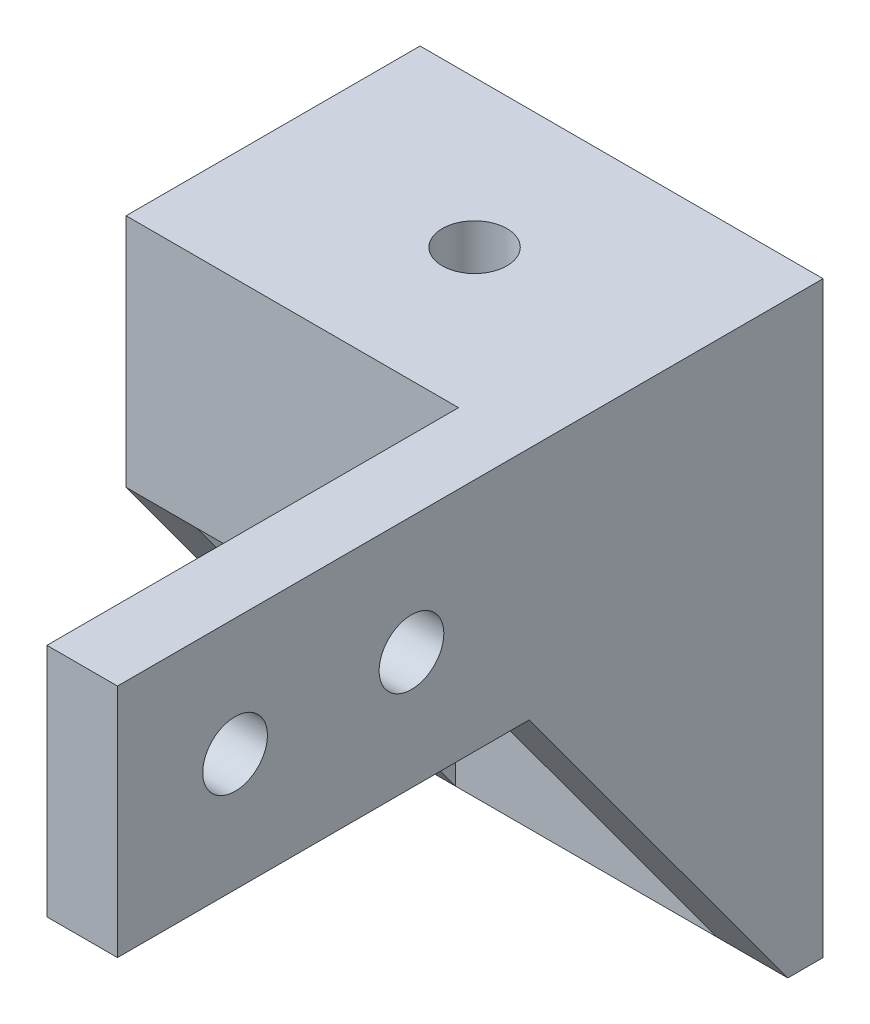
ISO-10303-21;
HEADER;
FILE_DESCRIPTION(('STEP AP214'),'2;1');
FILE_NAME('part.step','',(''),(''),'','','');
FILE_SCHEMA(('AUTOMOTIVE_DESIGN { 1 0 10303 214 1 1 1 1 }'));
ENDSEC;
DATA;
#1=APPLICATION_CONTEXT('core data for automotive mechanical design processes');
#2=APPLICATION_PROTOCOL_DEFINITION('international standard','automotive_design',2000,#1);
#3=PRODUCT_CONTEXT('',#1,'mechanical');
#4=PRODUCT('Part','Part','',(#3));
#5=PRODUCT_RELATED_PRODUCT_CATEGORY('part','',(#4));
#6=PRODUCT_DEFINITION_FORMATION('','',#4);
#7=PRODUCT_DEFINITION_CONTEXT('part definition',#1,'design');
#8=PRODUCT_DEFINITION('design','',#6,#7);
#9=PRODUCT_DEFINITION_SHAPE('','',#8);
#10=(LENGTH_UNIT() NAMED_UNIT(*) SI_UNIT(.MILLI.,.METRE.));
#11=(NAMED_UNIT(*) PLANE_ANGLE_UNIT() SI_UNIT($,.RADIAN.));
#12=(NAMED_UNIT(*) SI_UNIT($,.STERADIAN.) SOLID_ANGLE_UNIT());
#13=UNCERTAINTY_MEASURE_WITH_UNIT(LENGTH_MEASURE(1.E-05),#10,'distance_accuracy_value','');
#14=(GEOMETRIC_REPRESENTATION_CONTEXT(3) GLOBAL_UNCERTAINTY_ASSIGNED_CONTEXT((#13)) GLOBAL_UNIT_ASSIGNED_CONTEXT((#10,
#11,#12)) REPRESENTATION_CONTEXT('',''));
#15=CARTESIAN_POINT('',(0.,0.,0.));
#16=DIRECTION('',(0.,0.,1.));
#17=DIRECTION('',(1.,0.,0.));
#18=AXIS2_PLACEMENT_3D('',#15,#16,#17);
#19=CARTESIAN_POINT('',(35.7360752377383,0.,0.));
#20=DIRECTION('',(0.,-0.591363663627517,0.806404995855705));
#21=DIRECTION('',(0.,-0.806404995855705,-0.591363663627517));
#22=AXIS2_PLACEMENT_3D('',#19,#20,#21);
#23=PLANE('',#22);
#24=DIRECTION('',(0.,-0.806404995855705,-0.591363663627517));
#25=VECTOR('',#24,1.);
#26=CARTESIAN_POINT('',(3.,0.,0.));
#27=LINE('',#26,#25);
#28=CARTESIAN_POINT('',(3.,0.,0.));
#29=VERTEX_POINT('',#28);
#30=CARTESIAN_POINT('',(3.,-15.,-11.));
#31=VERTEX_POINT('',#30);
#32=EDGE_CURVE('E13',#29,#31,#27,.T.);
#33=ORIENTED_EDGE('',*,*,#32,.F.);
#34=DIRECTION('',(1.,0.,0.));
#35=VECTOR('',#34,1.);
#36=CARTESIAN_POINT('',(0.,0.,0.));
#37=LINE('',#36,#35);
#38=CARTESIAN_POINT('',(0.,0.,0.));
#39=VERTEX_POINT('',#38);
#40=EDGE_CURVE('E101',#39,#29,#37,.T.);
#41=ORIENTED_EDGE('',*,*,#40,.F.);
#42=DIRECTION('',(0.,0.806404995855705,0.591363663627517));
#43=VECTOR('',#42,1.);
#44=CARTESIAN_POINT('',(0.,0.,0.));
#45=LINE('',#44,#43);
#46=CARTESIAN_POINT('',(0.,-15.,-11.));
#47=VERTEX_POINT('',#46);
#48=EDGE_CURVE('E249',#47,#39,#45,.T.);
#49=ORIENTED_EDGE('',*,*,#48,.F.);
#50=DIRECTION('',(-1.,0.,0.));
#51=VECTOR('',#50,1.);
#52=CARTESIAN_POINT('',(17.135,-15.,-11.));
#53=LINE('',#52,#51);
#54=EDGE_CURVE('E109',#31,#47,#53,.T.);
#55=ORIENTED_EDGE('',*,*,#54,.F.);
#56=EDGE_LOOP('',(#33,#41,#49,#55));
#57=FACE_BOUND('',#56,.T.);
#58=ADVANCED_FACE('F54',(#57),#23,.T.);
#59=CARTESIAN_POINT('',(0.,5.,0.));
#60=DIRECTION('',(1.,0.,0.));
#61=DIRECTION('',(0.,0.,-1.));
#62=AXIS2_PLACEMENT_3D('',#59,#60,#61);
#63=PLANE('',#62);
#64=ORIENTED_EDGE('',*,*,#48,.T.);
#65=DIRECTION('',(0.,-1.,0.));
#66=VECTOR('',#65,1.);
#67=CARTESIAN_POINT('',(0.,5.,0.));
#68=LINE('',#67,#66);
#69=CARTESIAN_POINT('',(0.,10.,0.));
#70=VERTEX_POINT('',#69);
#71=EDGE_CURVE('E277',#70,#39,#68,.T.);
#72=ORIENTED_EDGE('',*,*,#71,.F.);
#73=DIRECTION('',(0.,0.,1.));
#74=VECTOR('',#73,1.);
#75=CARTESIAN_POINT('',(0.,10.,-12.5));
#76=LINE('',#75,#74);
#77=CARTESIAN_POINT('',(0.,10.,-12.5));
#78=VERTEX_POINT('',#77);
#79=EDGE_CURVE('E201',#78,#70,#76,.T.);
#80=ORIENTED_EDGE('',*,*,#79,.F.);
#81=DIRECTION('',(0.,-1.,0.));
#82=VECTOR('',#81,1.);
#83=CARTESIAN_POINT('',(0.,5.,-12.5));
#84=LINE('',#83,#82);
#85=CARTESIAN_POINT('',(0.,-15.,-12.5));
#86=VERTEX_POINT('',#85);
#87=EDGE_CURVE('E272',#78,#86,#84,.T.);
#88=ORIENTED_EDGE('',*,*,#87,.T.);
#89=DIRECTION('',(0.,0.,-1.));
#90=VECTOR('',#89,1.);
#91=CARTESIAN_POINT('',(0.,-15.,-11.));
#92=LINE('',#91,#90);
#93=EDGE_CURVE('E264',#47,#86,#92,.T.);
#94=ORIENTED_EDGE('',*,*,#93,.F.);
#95=EDGE_LOOP('',(#64,#72,#80,#88,#94));
#96=FACE_BOUND('',#95,.T.);
#97=ADVANCED_FACE('F56',(#96),#63,.F.);
#98=CARTESIAN_POINT('',(0.,5.,0.));
#99=DIRECTION('',(0.,0.,-1.));
#100=DIRECTION('',(-1.,0.,0.));
#101=AXIS2_PLACEMENT_3D('',#98,#99,#100);
#102=PLANE('',#101);
#103=DIRECTION('',(-1.,0.,0.));
#104=VECTOR('',#103,1.);
#105=CARTESIAN_POINT('',(3.,0.,0.));
#106=LINE('',#105,#104);
#107=CARTESIAN_POINT('',(14.135,0.,0.));
#108=VERTEX_POINT('',#107);
#109=EDGE_CURVE('E225',#108,#29,#106,.T.);
#110=ORIENTED_EDGE('',*,*,#109,.F.);
#111=DIRECTION('',(0.,1.,0.));
#112=VECTOR('',#111,1.);
#113=CARTESIAN_POINT('',(14.135,10.,0.));
#114=LINE('',#113,#112);
#115=CARTESIAN_POINT('',(14.135,10.,0.));
#116=VERTEX_POINT('',#115);
#117=EDGE_CURVE('E176',#108,#116,#114,.T.);
#118=ORIENTED_EDGE('',*,*,#117,.T.);
#119=DIRECTION('',(1.,0.,0.));
#120=VECTOR('',#119,1.);
#121=CARTESIAN_POINT('',(0.,10.,0.));
#122=LINE('',#121,#120);
#123=EDGE_CURVE('E174',#70,#116,#122,.T.);
#124=ORIENTED_EDGE('',*,*,#123,.F.);
#125=ORIENTED_EDGE('',*,*,#71,.T.);
#126=ORIENTED_EDGE('',*,*,#40,.T.);
#127=EDGE_LOOP('',(#110,#118,#124,#125,#126));
#128=FACE_BOUND('',#127,.T.);
#129=ADVANCED_FACE('F293',(#128),#102,.F.);
#130=CARTESIAN_POINT('',(17.135,5.,0.));
#131=DIRECTION('',(-1.,0.,0.));
#132=DIRECTION('',(0.,0.,1.));
#133=AXIS2_PLACEMENT_3D('',#130,#131,#132);
#134=PLANE('',#133);
#135=DIRECTION('',(0.,0.,-1.));
#136=VECTOR('',#135,1.);
#137=CARTESIAN_POINT('',(17.135,10.,0.));
#138=LINE('',#137,#136);
#139=CARTESIAN_POINT('',(17.135,10.,17.5));
#140=VERTEX_POINT('',#139);
#141=CARTESIAN_POINT('',(17.135,10.,-12.5));
#142=VERTEX_POINT('',#141);
#143=EDGE_CURVE('E206',#140,#142,#138,.T.);
#144=ORIENTED_EDGE('',*,*,#143,.F.);
#145=DIRECTION('',(0.,-1.,0.));
#146=VECTOR('',#145,1.);
#147=CARTESIAN_POINT('',(17.135,10.,17.5));
#148=LINE('',#147,#146);
#149=CARTESIAN_POINT('',(17.135,0.,17.5));
#150=VERTEX_POINT('',#149);
#151=EDGE_CURVE('E157',#140,#150,#148,.T.);
#152=ORIENTED_EDGE('',*,*,#151,.T.);
#153=DIRECTION('',(0.,0.,-1.));
#154=VECTOR('',#153,1.);
#155=CARTESIAN_POINT('',(17.135,0.,0.));
#156=LINE('',#155,#154);
#157=CARTESIAN_POINT('',(17.135,0.,0.));
#158=VERTEX_POINT('',#157);
#159=EDGE_CURVE('E180',#150,#158,#156,.T.);
#160=ORIENTED_EDGE('',*,*,#159,.T.);
#161=DIRECTION('',(0.,-0.806404995855705,-0.591363663627517));
#162=VECTOR('',#161,1.);
#163=CARTESIAN_POINT('',(17.135,0.,0.));
#164=LINE('',#163,#162);
#165=CARTESIAN_POINT('',(17.135,-15.,-11.));
#166=VERTEX_POINT('',#165);
#167=EDGE_CURVE('E253',#158,#166,#164,.T.);
#168=ORIENTED_EDGE('',*,*,#167,.T.);
#169=DIRECTION('',(0.,0.,-1.));
#170=VECTOR('',#169,1.);
#171=CARTESIAN_POINT('',(17.135,-15.,-11.));
#172=LINE('',#171,#170);
#173=CARTESIAN_POINT('',(17.135,-15.,-12.5));
#174=VERTEX_POINT('',#173);
#175=EDGE_CURVE('E261',#166,#174,#172,.T.);
#176=ORIENTED_EDGE('',*,*,#175,.T.);
#177=DIRECTION('',(0.,-1.,0.));
#178=VECTOR('',#177,1.);
#179=CARTESIAN_POINT('',(17.135,5.,-12.5));
#180=LINE('',#179,#178);
#181=EDGE_CURVE('E93',#142,#174,#180,.T.);
#182=ORIENTED_EDGE('',*,*,#181,.F.);
#183=EDGE_LOOP('',(#144,#152,#160,#168,#176,#182));
#184=FACE_BOUND('',#183,.T.);
#185=CARTESIAN_POINT('',(17.135,5.,12.5));
#186=DIRECTION('',(1.,0.,0.));
#187=DIRECTION('',(0.,0.,-1.));
#188=AXIS2_PLACEMENT_3D('',#185,#186,#187);
#189=CIRCLE('',#188,1.375);
#190=CARTESIAN_POINT('',(17.135,5.,11.125));
#191=VERTEX_POINT('',#190);
#192=EDGE_CURVE('E564',#191,#191,#189,.T.);
#193=ORIENTED_EDGE('',*,*,#192,.F.);
#194=EDGE_LOOP('',(#193));
#195=FACE_BOUND('',#194,.T.);
#196=CARTESIAN_POINT('',(17.135,5.,5.));
#197=DIRECTION('',(1.,0.,0.));
#198=DIRECTION('',(0.,0.,-1.));
#199=AXIS2_PLACEMENT_3D('',#196,#197,#198);
#200=CIRCLE('',#199,1.375);
#201=CARTESIAN_POINT('',(17.135,5.,3.625));
#202=VERTEX_POINT('',#201);
#203=EDGE_CURVE('E569',#202,#202,#200,.T.);
#204=ORIENTED_EDGE('',*,*,#203,.F.);
#205=EDGE_LOOP('',(#204));
#206=FACE_BOUND('',#205,.T.);
#207=ADVANCED_FACE('F306',(#184,#195,#206),#134,.F.);
#208=CARTESIAN_POINT('',(0.,5.,-12.5));
#209=DIRECTION('',(0.,0.,1.));
#210=DIRECTION('',(1.,0.,0.));
#211=AXIS2_PLACEMENT_3D('',#208,#209,#210);
#212=PLANE('',#211);
#213=CARTESIAN_POINT('',(8.5675,-11.,-12.5));
#214=DIRECTION('',(0.,0.,1.));
#215=DIRECTION('',(1.,0.,0.));
#216=AXIS2_PLACEMENT_3D('',#213,#214,#215);
#217=CIRCLE('',#216,1.375);
#218=CARTESIAN_POINT('',(9.9425,-11.,-12.5));
#219=VERTEX_POINT('',#218);
#220=EDGE_CURVE('E221',#219,#219,#217,.T.);
#221=ORIENTED_EDGE('',*,*,#220,.T.);
#222=EDGE_LOOP('',(#221));
#223=FACE_BOUND('',#222,.T.);
#224=CARTESIAN_POINT('',(8.5675,-4.,-12.5));
#225=DIRECTION('',(0.,0.,1.));
#226=DIRECTION('',(1.,0.,0.));
#227=AXIS2_PLACEMENT_3D('',#224,#225,#226);
#228=CIRCLE('',#227,1.375);
#229=CARTESIAN_POINT('',(9.9425,-4.,-12.5));
#230=VERTEX_POINT('',#229);
#231=EDGE_CURVE('E213',#230,#230,#228,.T.);
#232=ORIENTED_EDGE('',*,*,#231,.T.);
#233=EDGE_LOOP('',(#232));
#234=FACE_BOUND('',#233,.T.);
#235=ORIENTED_EDGE('',*,*,#181,.T.);
#236=DIRECTION('',(-1.,0.,0.));
#237=VECTOR('',#236,1.);
#238=CARTESIAN_POINT('',(17.135,-15.,-12.5));
#239=LINE('',#238,#237);
#240=EDGE_CURVE('E256',#174,#86,#239,.T.);
#241=ORIENTED_EDGE('',*,*,#240,.T.);
#242=ORIENTED_EDGE('',*,*,#87,.F.);
#243=DIRECTION('',(-1.,0.,0.));
#244=VECTOR('',#243,1.);
#245=CARTESIAN_POINT('',(17.135,10.,-12.5));
#246=LINE('',#245,#244);
#247=EDGE_CURVE('E198',#142,#78,#246,.T.);
#248=ORIENTED_EDGE('',*,*,#247,.F.);
#249=EDGE_LOOP('',(#235,#241,#242,#248));
#250=FACE_BOUND('',#249,.T.);
#251=ADVANCED_FACE('F332',(#223,#234,#250),#212,.F.);
#252=CARTESIAN_POINT('',(17.135,-15.,-11.));
#253=DIRECTION('',(0.,-1.,0.));
#254=DIRECTION('',(0.,0.,-1.));
#255=AXIS2_PLACEMENT_3D('',#252,#253,#254);
#256=PLANE('',#255);
#257=ORIENTED_EDGE('',*,*,#240,.F.);
#258=ORIENTED_EDGE('',*,*,#175,.F.);
#259=CARTESIAN_POINT('',(14.135,-15.,-11.));
#260=VERTEX_POINT('',#259);
#261=EDGE_CURVE('E80',#166,#260,#53,.T.);
#262=ORIENTED_EDGE('',*,*,#261,.T.);
#263=DIRECTION('',(1.,0.,0.));
#264=VECTOR('',#263,1.);
#265=CARTESIAN_POINT('',(3.,-15.,-11.));
#266=LINE('',#265,#264);
#267=EDGE_CURVE('E230',#31,#260,#266,.T.);
#268=ORIENTED_EDGE('',*,*,#267,.F.);
#269=ORIENTED_EDGE('',*,*,#54,.T.);
#270=ORIENTED_EDGE('',*,*,#93,.T.);
#271=EDGE_LOOP('',(#257,#258,#262,#268,#269,#270));
#272=FACE_BOUND('',#271,.T.);
#273=ADVANCED_FACE('F303',(#272),#256,.T.);
#274=DIRECTION('',(0.,0.806404995855705,0.591363663627517));
#275=VECTOR('',#274,1.);
#276=CARTESIAN_POINT('',(14.135,0.,0.));
#277=LINE('',#276,#275);
#278=EDGE_CURVE('E64',#260,#108,#277,.T.);
#279=ORIENTED_EDGE('',*,*,#278,.F.);
#280=ORIENTED_EDGE('',*,*,#261,.F.);
#281=ORIENTED_EDGE('',*,*,#167,.F.);
#282=EDGE_CURVE('E267',#108,#158,#37,.T.);
#283=ORIENTED_EDGE('',*,*,#282,.F.);
#284=EDGE_LOOP('',(#279,#280,#281,#283));
#285=FACE_BOUND('',#284,.T.);
#286=ADVANCED_FACE('F288',(#285),#23,.T.);
#287=CARTESIAN_POINT('',(3.,0.,-11.));
#288=DIRECTION('',(-1.,0.,0.));
#289=DIRECTION('',(0.,-1.,0.));
#290=AXIS2_PLACEMENT_3D('',#287,#288,#289);
#291=PLANE('',#290);
#292=ORIENTED_EDGE('',*,*,#32,.T.);
#293=DIRECTION('',(0.,-1.,0.));
#294=VECTOR('',#293,1.);
#295=CARTESIAN_POINT('',(3.,0.,-11.));
#296=LINE('',#295,#294);
#297=CARTESIAN_POINT('',(3.,0.,-11.));
#298=VERTEX_POINT('',#297);
#299=EDGE_CURVE('E226',#298,#31,#296,.T.);
#300=ORIENTED_EDGE('',*,*,#299,.F.);
#301=DIRECTION('',(0.,0.,1.));
#302=VECTOR('',#301,1.);
#303=CARTESIAN_POINT('',(3.,0.,-11.));
#304=LINE('',#303,#302);
#305=EDGE_CURVE('E246',#298,#29,#304,.T.);
#306=ORIENTED_EDGE('',*,*,#305,.T.);
#307=EDGE_LOOP('',(#292,#300,#306));
#308=FACE_BOUND('',#307,.T.);
#309=ADVANCED_FACE('F299',(#308),#291,.F.);
#310=CARTESIAN_POINT('',(3.,0.,-11.));
#311=DIRECTION('',(0.,1.,0.));
#312=DIRECTION('',(0.,0.,1.));
#313=AXIS2_PLACEMENT_3D('',#310,#311,#312);
#314=PLANE('',#313);
#315=CARTESIAN_POINT('',(8.5675,0.,-6.25));
#316=DIRECTION('',(0.,1.,0.));
#317=DIRECTION('',(0.,0.,1.));
#318=AXIS2_PLACEMENT_3D('',#315,#316,#317);
#319=CIRCLE('',#318,1.375);
#320=CARTESIAN_POINT('',(8.5675,0.,-4.875));
#321=VERTEX_POINT('',#320);
#322=EDGE_CURVE('E58',#321,#321,#319,.T.);
#323=ORIENTED_EDGE('',*,*,#322,.T.);
#324=EDGE_LOOP('',(#323));
#325=FACE_BOUND('',#324,.T.);
#326=ORIENTED_EDGE('',*,*,#109,.T.);
#327=ORIENTED_EDGE('',*,*,#305,.F.);
#328=DIRECTION('',(-1.,0.,0.));
#329=VECTOR('',#328,1.);
#330=CARTESIAN_POINT('',(3.,0.,-11.));
#331=LINE('',#330,#329);
#332=CARTESIAN_POINT('',(14.135,0.,-11.));
#333=VERTEX_POINT('',#332);
#334=EDGE_CURVE('E238',#333,#298,#331,.T.);
#335=ORIENTED_EDGE('',*,*,#334,.F.);
#336=DIRECTION('',(0.,0.,1.));
#337=VECTOR('',#336,1.);
#338=CARTESIAN_POINT('',(14.135,0.,-11.));
#339=LINE('',#338,#337);
#340=EDGE_CURVE('E242',#333,#108,#339,.T.);
#341=ORIENTED_EDGE('',*,*,#340,.T.);
#342=EDGE_LOOP('',(#326,#327,#335,#341));
#343=FACE_BOUND('',#342,.T.);
#344=ADVANCED_FACE('F295',(#325,#343),#314,.F.);
#345=CARTESIAN_POINT('',(14.135,0.,-11.));
#346=DIRECTION('',(1.,0.,0.));
#347=DIRECTION('',(0.,1.,0.));
#348=AXIS2_PLACEMENT_3D('',#345,#346,#347);
#349=PLANE('',#348);
#350=ORIENTED_EDGE('',*,*,#278,.T.);
#351=ORIENTED_EDGE('',*,*,#340,.F.);
#352=DIRECTION('',(0.,1.,0.));
#353=VECTOR('',#352,1.);
#354=CARTESIAN_POINT('',(14.135,0.,-11.));
#355=LINE('',#354,#353);
#356=EDGE_CURVE('E234',#260,#333,#355,.T.);
#357=ORIENTED_EDGE('',*,*,#356,.F.);
#358=EDGE_LOOP('',(#350,#351,#357));
#359=FACE_BOUND('',#358,.T.);
#360=ADVANCED_FACE('F286',(#359),#349,.F.);
#361=CARTESIAN_POINT('',(0.,0.,-11.));
#362=DIRECTION('',(0.,0.,1.));
#363=DIRECTION('',(1.,0.,0.));
#364=AXIS2_PLACEMENT_3D('',#361,#362,#363);
#365=PLANE('',#364);
#366=CARTESIAN_POINT('',(8.5675,-11.,-11.));
#367=DIRECTION('',(0.,0.,1.));
#368=DIRECTION('',(1.,0.,0.));
#369=AXIS2_PLACEMENT_3D('',#366,#367,#368);
#370=CIRCLE('',#369,1.375);
#371=CARTESIAN_POINT('',(9.9425,-11.,-11.));
#372=VERTEX_POINT('',#371);
#373=EDGE_CURVE('E209',#372,#372,#370,.T.);
#374=ORIENTED_EDGE('',*,*,#373,.F.);
#375=EDGE_LOOP('',(#374));
#376=FACE_BOUND('',#375,.T.);
#377=CARTESIAN_POINT('',(8.5675,-4.,-11.));
#378=DIRECTION('',(0.,0.,1.));
#379=DIRECTION('',(1.,0.,0.));
#380=AXIS2_PLACEMENT_3D('',#377,#378,#379);
#381=CIRCLE('',#380,1.375);
#382=CARTESIAN_POINT('',(9.9425,-4.,-11.));
#383=VERTEX_POINT('',#382);
#384=EDGE_CURVE('E214',#383,#383,#381,.T.);
#385=ORIENTED_EDGE('',*,*,#384,.F.);
#386=EDGE_LOOP('',(#385));
#387=FACE_BOUND('',#386,.T.);
#388=ORIENTED_EDGE('',*,*,#299,.T.);
#389=ORIENTED_EDGE('',*,*,#267,.T.);
#390=ORIENTED_EDGE('',*,*,#356,.T.);
#391=ORIENTED_EDGE('',*,*,#334,.T.);
#392=EDGE_LOOP('',(#388,#389,#390,#391));
#393=FACE_BOUND('',#392,.T.);
#394=ADVANCED_FACE('F301',(#376,#387,#393),#365,.T.);
#395=CARTESIAN_POINT('',(8.5675,-4.,-13.));
#396=DIRECTION('',(0.,0.,1.));
#397=DIRECTION('',(1.,0.,0.));
#398=AXIS2_PLACEMENT_3D('',#395,#396,#397);
#399=CYLINDRICAL_SURFACE('',#398,1.375);
#400=ORIENTED_EDGE('',*,*,#384,.T.);
#401=EDGE_LOOP('',(#400));
#402=FACE_BOUND('',#401,.T.);
#403=ORIENTED_EDGE('',*,*,#231,.F.);
#404=EDGE_LOOP('',(#403));
#405=FACE_BOUND('',#404,.T.);
#406=ADVANCED_FACE('F397',(#402,#405),#399,.F.);
#407=CARTESIAN_POINT('',(8.5675,-11.,-13.));
#408=DIRECTION('',(0.,0.,1.));
#409=DIRECTION('',(1.,0.,0.));
#410=AXIS2_PLACEMENT_3D('',#407,#408,#409);
#411=CYLINDRICAL_SURFACE('',#410,1.375);
#412=ORIENTED_EDGE('',*,*,#373,.T.);
#413=EDGE_LOOP('',(#412));
#414=FACE_BOUND('',#413,.T.);
#415=ORIENTED_EDGE('',*,*,#220,.F.);
#416=EDGE_LOOP('',(#415));
#417=FACE_BOUND('',#416,.T.);
#418=ADVANCED_FACE('F407',(#414,#417),#411,.F.);
#419=CARTESIAN_POINT('',(8.5675,-0.75,-6.25));
#420=DIRECTION('',(0.,1.,0.));
#421=DIRECTION('',(0.,0.,1.));
#422=AXIS2_PLACEMENT_3D('',#419,#420,#421);
#423=CYLINDRICAL_SURFACE('',#422,1.375);
#424=ORIENTED_EDGE('',*,*,#322,.F.);
#425=EDGE_LOOP('',(#424));
#426=FACE_BOUND('',#425,.T.);
#427=CARTESIAN_POINT('',(8.5675,10.,-6.25));
#428=DIRECTION('',(0.,1.,0.));
#429=DIRECTION('',(0.,0.,1.));
#430=AXIS2_PLACEMENT_3D('',#427,#428,#429);
#431=CIRCLE('',#430,1.375);
#432=CARTESIAN_POINT('',(8.5675,10.,-4.875));
#433=VERTEX_POINT('',#432);
#434=EDGE_CURVE('E193',#433,#433,#431,.T.);
#435=ORIENTED_EDGE('',*,*,#434,.T.);
#436=EDGE_LOOP('',(#435));
#437=FACE_BOUND('',#436,.T.);
#438=ADVANCED_FACE('F316',(#426,#437),#423,.F.);
#439=CARTESIAN_POINT('',(0.,10.,0.));
#440=DIRECTION('',(0.,1.,0.));
#441=DIRECTION('',(0.,0.,1.));
#442=AXIS2_PLACEMENT_3D('',#439,#440,#441);
#443=PLANE('',#442);
#444=ORIENTED_EDGE('',*,*,#247,.T.);
#445=ORIENTED_EDGE('',*,*,#79,.T.);
#446=ORIENTED_EDGE('',*,*,#123,.T.);
#447=DIRECTION('',(0.,0.,1.));
#448=VECTOR('',#447,1.);
#449=CARTESIAN_POINT('',(14.135,10.,0.));
#450=LINE('',#449,#448);
#451=CARTESIAN_POINT('',(14.135,10.,17.5));
#452=VERTEX_POINT('',#451);
#453=EDGE_CURVE('E71',#116,#452,#450,.T.);
#454=ORIENTED_EDGE('',*,*,#453,.T.);
#455=DIRECTION('',(1.,0.,0.));
#456=VECTOR('',#455,1.);
#457=CARTESIAN_POINT('',(14.135,10.,17.5));
#458=LINE('',#457,#456);
#459=EDGE_CURVE('E152',#452,#140,#458,.T.);
#460=ORIENTED_EDGE('',*,*,#459,.T.);
#461=ORIENTED_EDGE('',*,*,#143,.T.);
#462=EDGE_LOOP('',(#444,#445,#446,#454,#460,#461));
#463=FACE_BOUND('',#462,.T.);
#464=ORIENTED_EDGE('',*,*,#434,.F.);
#465=EDGE_LOOP('',(#464));
#466=FACE_BOUND('',#465,.T.);
#467=ADVANCED_FACE('F170',(#463,#466),#443,.T.);
#468=CARTESIAN_POINT('',(14.135,0.,0.));
#469=DIRECTION('',(0.,-1.,0.));
#470=DIRECTION('',(0.,0.,-1.));
#471=AXIS2_PLACEMENT_3D('',#468,#469,#470);
#472=PLANE('',#471);
#473=ORIENTED_EDGE('',*,*,#159,.F.);
#474=DIRECTION('',(1.,0.,0.));
#475=VECTOR('',#474,1.);
#476=CARTESIAN_POINT('',(14.135,0.,17.5));
#477=LINE('',#476,#475);
#478=CARTESIAN_POINT('',(14.135,0.,17.5));
#479=VERTEX_POINT('',#478);
#480=EDGE_CURVE('E161',#479,#150,#477,.T.);
#481=ORIENTED_EDGE('',*,*,#480,.F.);
#482=DIRECTION('',(0.,0.,-1.));
#483=VECTOR('',#482,1.);
#484=CARTESIAN_POINT('',(14.135,0.,0.));
#485=LINE('',#484,#483);
#486=EDGE_CURVE('E162',#479,#108,#485,.T.);
#487=ORIENTED_EDGE('',*,*,#486,.T.);
#488=ORIENTED_EDGE('',*,*,#282,.T.);
#489=EDGE_LOOP('',(#473,#481,#487,#488));
#490=FACE_BOUND('',#489,.T.);
#491=ADVANCED_FACE('F308',(#490),#472,.T.);
#492=CARTESIAN_POINT('',(14.135,10.,17.5));
#493=DIRECTION('',(0.,0.,1.));
#494=DIRECTION('',(1.,0.,0.));
#495=AXIS2_PLACEMENT_3D('',#492,#493,#494);
#496=PLANE('',#495);
#497=ORIENTED_EDGE('',*,*,#151,.F.);
#498=ORIENTED_EDGE('',*,*,#459,.F.);
#499=DIRECTION('',(0.,-1.,0.));
#500=VECTOR('',#499,1.);
#501=CARTESIAN_POINT('',(14.135,10.,17.5));
#502=LINE('',#501,#500);
#503=EDGE_CURVE('E154',#452,#479,#502,.T.);
#504=ORIENTED_EDGE('',*,*,#503,.T.);
#505=ORIENTED_EDGE('',*,*,#480,.T.);
#506=EDGE_LOOP('',(#497,#498,#504,#505));
#507=FACE_BOUND('',#506,.T.);
#508=ADVANCED_FACE('F153',(#507),#496,.T.);
#509=CARTESIAN_POINT('',(14.135,0.,0.));
#510=DIRECTION('',(-1.,0.,0.));
#511=DIRECTION('',(0.,0.,1.));
#512=AXIS2_PLACEMENT_3D('',#509,#510,#511);
#513=PLANE('',#512);
#514=CARTESIAN_POINT('',(14.135,5.,12.5));
#515=DIRECTION('',(1.,0.,0.));
#516=DIRECTION('',(0.,0.,-1.));
#517=AXIS2_PLACEMENT_3D('',#514,#515,#516);
#518=CIRCLE('',#517,1.375);
#519=CARTESIAN_POINT('',(14.135,5.,11.125));
#520=VERTEX_POINT('',#519);
#521=EDGE_CURVE('E561',#520,#520,#518,.T.);
#522=ORIENTED_EDGE('',*,*,#521,.T.);
#523=EDGE_LOOP('',(#522));
#524=FACE_BOUND('',#523,.T.);
#525=CARTESIAN_POINT('',(14.135,5.,5.));
#526=DIRECTION('',(1.,0.,0.));
#527=DIRECTION('',(0.,0.,-1.));
#528=AXIS2_PLACEMENT_3D('',#525,#526,#527);
#529=CIRCLE('',#528,1.375);
#530=CARTESIAN_POINT('',(14.135,5.,3.625));
#531=VERTEX_POINT('',#530);
#532=EDGE_CURVE('E188',#531,#531,#529,.T.);
#533=ORIENTED_EDGE('',*,*,#532,.T.);
#534=EDGE_LOOP('',(#533));
#535=FACE_BOUND('',#534,.T.);
#536=ORIENTED_EDGE('',*,*,#117,.F.);
#537=ORIENTED_EDGE('',*,*,#486,.F.);
#538=ORIENTED_EDGE('',*,*,#503,.F.);
#539=ORIENTED_EDGE('',*,*,#453,.F.);
#540=EDGE_LOOP('',(#536,#537,#538,#539));
#541=FACE_BOUND('',#540,.T.);
#542=ADVANCED_FACE('F164',(#524,#535,#541),#513,.T.);
#543=CARTESIAN_POINT('',(14.135,5.,5.));
#544=DIRECTION('',(1.,0.,0.));
#545=DIRECTION('',(0.,0.,-1.));
#546=AXIS2_PLACEMENT_3D('',#543,#544,#545);
#547=CYLINDRICAL_SURFACE('',#546,1.375);
#548=ORIENTED_EDGE('',*,*,#532,.F.);
#549=EDGE_LOOP('',(#548));
#550=FACE_BOUND('',#549,.T.);
#551=ORIENTED_EDGE('',*,*,#203,.T.);
#552=EDGE_LOOP('',(#551));
#553=FACE_BOUND('',#552,.T.);
#554=ADVANCED_FACE('F449',(#550,#553),#547,.F.);
#555=CARTESIAN_POINT('',(14.135,5.,12.5));
#556=DIRECTION('',(1.,0.,0.));
#557=DIRECTION('',(0.,0.,-1.));
#558=AXIS2_PLACEMENT_3D('',#555,#556,#557);
#559=CYLINDRICAL_SURFACE('',#558,1.375);
#560=ORIENTED_EDGE('',*,*,#521,.F.);
#561=EDGE_LOOP('',(#560));
#562=FACE_BOUND('',#561,.T.);
#563=ORIENTED_EDGE('',*,*,#192,.T.);
#564=EDGE_LOOP('',(#563));
#565=FACE_BOUND('',#564,.T.);
#566=ADVANCED_FACE('F458',(#562,#565),#559,.F.);
#567=CLOSED_SHELL('',(#58,#97,#129,#207,#251,#273,#286,#309,#344,#360,#394,#406,#418,#438,#467,
#491,#508,#542,#554,#566));
#568=MANIFOLD_SOLID_BREP('B2',#567);
#569=ADVANCED_BREP_SHAPE_REPRESENTATION('',(#18,#568),#14);
#570=SHAPE_DEFINITION_REPRESENTATION(#9,#569);
ENDSEC;
END-ISO-10303-21;
